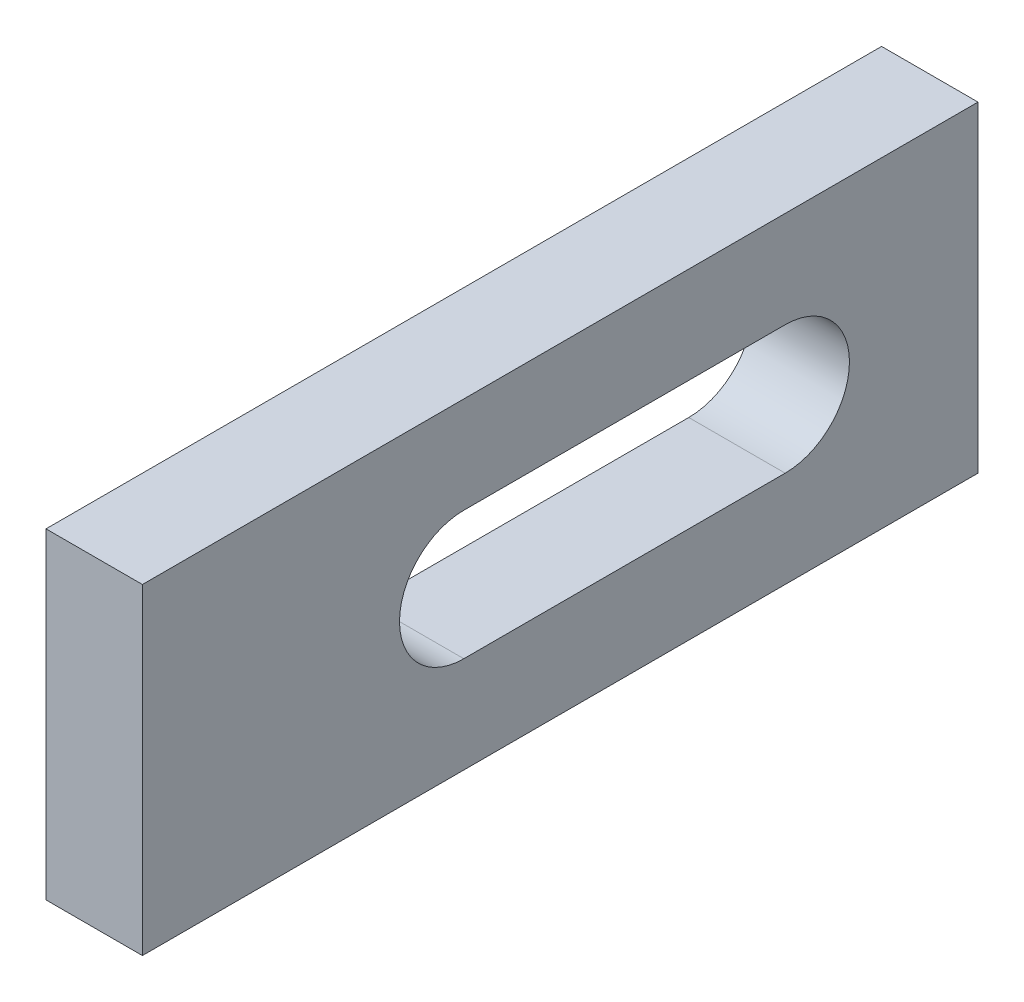
ISO-10303-21;
HEADER;
FILE_DESCRIPTION(('STEP AP214'),'2;1');
FILE_NAME('part.step','',(''),(''),'','','');
FILE_SCHEMA(('AUTOMOTIVE_DESIGN { 1 0 10303 214 1 1 1 1 }'));
ENDSEC;
DATA;
#1=APPLICATION_CONTEXT('core data for automotive mechanical design processes');
#2=APPLICATION_PROTOCOL_DEFINITION('international standard','automotive_design',2000,#1);
#3=PRODUCT_CONTEXT('',#1,'mechanical');
#4=PRODUCT('Part','Part','',(#3));
#5=PRODUCT_RELATED_PRODUCT_CATEGORY('part','',(#4));
#6=PRODUCT_DEFINITION_FORMATION('','',#4);
#7=PRODUCT_DEFINITION_CONTEXT('part definition',#1,'design');
#8=PRODUCT_DEFINITION('design','',#6,#7);
#9=PRODUCT_DEFINITION_SHAPE('','',#8);
#10=(LENGTH_UNIT() NAMED_UNIT(*) SI_UNIT(.MILLI.,.METRE.));
#11=(NAMED_UNIT(*) PLANE_ANGLE_UNIT() SI_UNIT($,.RADIAN.));
#12=(NAMED_UNIT(*) SI_UNIT($,.STERADIAN.) SOLID_ANGLE_UNIT());
#13=UNCERTAINTY_MEASURE_WITH_UNIT(LENGTH_MEASURE(1.E-05),#10,'distance_accuracy_value','');
#14=(GEOMETRIC_REPRESENTATION_CONTEXT(3) GLOBAL_UNCERTAINTY_ASSIGNED_CONTEXT((#13)) GLOBAL_UNIT_ASSIGNED_CONTEXT((#10,
#11,#12)) REPRESENTATION_CONTEXT('',''));
#15=CARTESIAN_POINT('',(0.,0.,0.));
#16=DIRECTION('',(0.,0.,1.));
#17=DIRECTION('',(1.,0.,0.));
#18=AXIS2_PLACEMENT_3D('',#15,#16,#17);
#19=CARTESIAN_POINT('',(-7.5,-24.9999999999999,65.0000000000002));
#20=DIRECTION('',(1.,0.,0.));
#21=DIRECTION('',(0.,0.,-1.));
#22=AXIS2_PLACEMENT_3D('',#19,#20,#21);
#23=PLANE('',#22);
#24=DIRECTION('',(0.,0.,1.));
#25=VECTOR('',#24,1.);
#26=CARTESIAN_POINT('',(-7.5,10.0000000000002,64.9999999999999));
#27=LINE('',#26,#25);
#28=CARTESIAN_POINT('',(-7.50000000000001,10.,-34.9999999999997));
#29=VERTEX_POINT('',#28);
#30=CARTESIAN_POINT('',(-7.50000000000001,9.99999999999979,15.0000000000002));
#31=VERTEX_POINT('',#30);
#32=EDGE_CURVE('E127',#29,#31,#27,.T.);
#33=ORIENTED_EDGE('',*,*,#32,.T.);
#34=CARTESIAN_POINT('',(-7.50000000000001,0.,15.0000000000002));
#35=DIRECTION('',(1.,0.,0.));
#36=DIRECTION('',(0.,0.,-1.));
#37=AXIS2_PLACEMENT_3D('',#34,#35,#36);
#38=CIRCLE('',#37,10.);
#39=CARTESIAN_POINT('',(-7.50000000000001,-10.,15.));
#40=VERTEX_POINT('',#39);
#41=EDGE_CURVE('E130',#31,#40,#38,.T.);
#42=ORIENTED_EDGE('',*,*,#41,.T.);
#43=DIRECTION('',(0.,0.,-1.));
#44=VECTOR('',#43,1.);
#45=CARTESIAN_POINT('',(-7.5,-9.99999999999979,65.0000000000004));
#46=LINE('',#45,#44);
#47=CARTESIAN_POINT('',(-7.5,-10.,-34.9999999999997));
#48=VERTEX_POINT('',#47);
#49=EDGE_CURVE('E122',#40,#48,#46,.T.);
#50=ORIENTED_EDGE('',*,*,#49,.T.);
#51=CARTESIAN_POINT('',(-7.50000000000001,0.,-34.9999999999999));
#52=DIRECTION('',(1.,0.,0.));
#53=DIRECTION('',(0.,0.,-1.));
#54=AXIS2_PLACEMENT_3D('',#51,#52,#53);
#55=CIRCLE('',#54,10.);
#56=EDGE_CURVE('E102',#48,#29,#55,.T.);
#57=ORIENTED_EDGE('',*,*,#56,.T.);
#58=EDGE_LOOP('',(#33,#42,#50,#57));
#59=FACE_BOUND('',#58,.T.);
#60=DIRECTION('',(0.,-1.,0.));
#61=VECTOR('',#60,1.);
#62=CARTESIAN_POINT('',(-7.5,-25.0000000000001,-64.9999999999999));
#63=LINE('',#62,#61);
#64=CARTESIAN_POINT('',(-7.5,24.9999999999999,-64.9999999999999));
#65=VERTEX_POINT('',#64);
#66=CARTESIAN_POINT('',(-7.5,-25.0000000000001,-64.9999999999999));
#67=VERTEX_POINT('',#66);
#68=EDGE_CURVE('E133',#65,#67,#63,.T.);
#69=ORIENTED_EDGE('',*,*,#68,.T.);
#70=DIRECTION('',(0.,0.,-1.));
#71=VECTOR('',#70,1.);
#72=CARTESIAN_POINT('',(-7.5,-24.9999999999999,65.0000000000002));
#73=LINE('',#72,#71);
#74=CARTESIAN_POINT('',(-7.5,-24.9999999999999,65.0000000000002));
#75=VERTEX_POINT('',#74);
#76=EDGE_CURVE('E11',#75,#67,#73,.T.);
#77=ORIENTED_EDGE('',*,*,#76,.F.);
#78=DIRECTION('',(0.,-1.,0.));
#79=VECTOR('',#78,1.);
#80=CARTESIAN_POINT('',(-7.5,-24.9999999999999,65.0000000000002));
#81=LINE('',#80,#79);
#82=CARTESIAN_POINT('',(-7.5,25.0000000000001,65.0000000000003));
#83=VERTEX_POINT('',#82);
#84=EDGE_CURVE('E134',#83,#75,#81,.T.);
#85=ORIENTED_EDGE('',*,*,#84,.F.);
#86=DIRECTION('',(0.,0.,-1.));
#87=VECTOR('',#86,1.);
#88=CARTESIAN_POINT('',(-7.5,25.0000000000001,65.0000000000003));
#89=LINE('',#88,#87);
#90=EDGE_CURVE('E144',#83,#65,#89,.T.);
#91=ORIENTED_EDGE('',*,*,#90,.T.);
#92=EDGE_LOOP('',(#69,#77,#85,#91));
#93=FACE_BOUND('',#92,.T.);
#94=ADVANCED_FACE('F32',(#59,#93),#23,.F.);
#95=CARTESIAN_POINT('',(-7.5,-24.9999999999999,65.0000000000002));
#96=DIRECTION('',(0.,1.,0.));
#97=DIRECTION('',(0.,0.,1.));
#98=AXIS2_PLACEMENT_3D('',#95,#96,#97);
#99=PLANE('',#98);
#100=DIRECTION('',(1.,0.,0.));
#101=VECTOR('',#100,1.);
#102=CARTESIAN_POINT('',(-7.5,-25.0000000000001,-64.9999999999999));
#103=LINE('',#102,#101);
#104=CARTESIAN_POINT('',(7.5,-25.0000000000001,-64.9999999999999));
#105=VERTEX_POINT('',#104);
#106=EDGE_CURVE('E147',#67,#105,#103,.T.);
#107=ORIENTED_EDGE('',*,*,#106,.T.);
#108=DIRECTION('',(0.,0.,-1.));
#109=VECTOR('',#108,1.);
#110=CARTESIAN_POINT('',(7.5,-25.0000000000001,65.0000000000002));
#111=LINE('',#110,#109);
#112=CARTESIAN_POINT('',(7.5,-25.0000000000001,65.0000000000002));
#113=VERTEX_POINT('',#112);
#114=EDGE_CURVE('E39',#113,#105,#111,.T.);
#115=ORIENTED_EDGE('',*,*,#114,.F.);
#116=DIRECTION('',(1.,0.,0.));
#117=VECTOR('',#116,1.);
#118=CARTESIAN_POINT('',(-7.5,-24.9999999999999,65.0000000000002));
#119=LINE('',#118,#117);
#120=EDGE_CURVE('E137',#75,#113,#119,.T.);
#121=ORIENTED_EDGE('',*,*,#120,.F.);
#122=ORIENTED_EDGE('',*,*,#76,.T.);
#123=EDGE_LOOP('',(#107,#115,#121,#122));
#124=FACE_BOUND('',#123,.T.);
#125=ADVANCED_FACE('F175',(#124),#99,.F.);
#126=CARTESIAN_POINT('',(7.5,-25.0000000000001,65.0000000000002));
#127=DIRECTION('',(-1.,0.,0.));
#128=DIRECTION('',(0.,0.,1.));
#129=AXIS2_PLACEMENT_3D('',#126,#127,#128);
#130=PLANE('',#129);
#131=DIRECTION('',(0.,0.,-1.));
#132=VECTOR('',#131,1.);
#133=CARTESIAN_POINT('',(7.5,-10.0000000000002,-34.9999999999999));
#134=LINE('',#133,#132);
#135=CARTESIAN_POINT('',(7.5,-10.,15.0000000000001));
#136=VERTEX_POINT('',#135);
#137=CARTESIAN_POINT('',(7.5,-10.0000000000002,-34.9999999999999));
#138=VERTEX_POINT('',#137);
#139=EDGE_CURVE('E108',#136,#138,#134,.T.);
#140=ORIENTED_EDGE('',*,*,#139,.F.);
#141=CARTESIAN_POINT('',(7.5,0.,15.0000000000001));
#142=DIRECTION('',(1.,0.,0.));
#143=DIRECTION('',(0.,0.,-1.));
#144=AXIS2_PLACEMENT_3D('',#141,#142,#143);
#145=CIRCLE('',#144,10.);
#146=CARTESIAN_POINT('',(7.5,9.99999999999979,15.0000000000002));
#147=VERTEX_POINT('',#146);
#148=EDGE_CURVE('E54',#147,#136,#145,.T.);
#149=ORIENTED_EDGE('',*,*,#148,.F.);
#150=DIRECTION('',(0.,0.,1.));
#151=VECTOR('',#150,1.);
#152=CARTESIAN_POINT('',(7.5,9.99999999999979,15.0000000000002));
#153=LINE('',#152,#151);
#154=CARTESIAN_POINT('',(7.5,10.0000000000002,-34.9999999999999));
#155=VERTEX_POINT('',#154);
#156=EDGE_CURVE('E115',#155,#147,#153,.T.);
#157=ORIENTED_EDGE('',*,*,#156,.F.);
#158=CARTESIAN_POINT('',(7.5,0.,-34.9999999999999));
#159=DIRECTION('',(1.,0.,0.));
#160=DIRECTION('',(0.,0.,-1.));
#161=AXIS2_PLACEMENT_3D('',#158,#159,#160);
#162=CIRCLE('',#161,10.);
#163=EDGE_CURVE('E99',#138,#155,#162,.T.);
#164=ORIENTED_EDGE('',*,*,#163,.F.);
#165=EDGE_LOOP('',(#140,#149,#157,#164));
#166=FACE_BOUND('',#165,.T.);
#167=DIRECTION('',(0.,1.,0.));
#168=VECTOR('',#167,1.);
#169=CARTESIAN_POINT('',(7.5,-25.0000000000001,-64.9999999999999));
#170=LINE('',#169,#168);
#171=CARTESIAN_POINT('',(7.5,24.9999999999999,-64.9999999999999));
#172=VERTEX_POINT('',#171);
#173=EDGE_CURVE('E149',#105,#172,#170,.T.);
#174=ORIENTED_EDGE('',*,*,#173,.T.);
#175=DIRECTION('',(0.,0.,-1.));
#176=VECTOR('',#175,1.);
#177=CARTESIAN_POINT('',(7.5,24.9999999999999,64.9999999999999));
#178=LINE('',#177,#176);
#179=CARTESIAN_POINT('',(7.5,24.9999999999999,64.9999999999999));
#180=VERTEX_POINT('',#179);
#181=EDGE_CURVE('E154',#180,#172,#178,.T.);
#182=ORIENTED_EDGE('',*,*,#181,.F.);
#183=DIRECTION('',(0.,1.,0.));
#184=VECTOR('',#183,1.);
#185=CARTESIAN_POINT('',(7.5,-25.0000000000001,65.0000000000002));
#186=LINE('',#185,#184);
#187=EDGE_CURVE('E140',#113,#180,#186,.T.);
#188=ORIENTED_EDGE('',*,*,#187,.F.);
#189=ORIENTED_EDGE('',*,*,#114,.T.);
#190=EDGE_LOOP('',(#174,#182,#188,#189));
#191=FACE_BOUND('',#190,.T.);
#192=ADVANCED_FACE('F112',(#166,#191),#130,.F.);
#193=CARTESIAN_POINT('',(-7.5,25.0000000000001,65.0000000000003));
#194=DIRECTION('',(0.,-1.,0.));
#195=DIRECTION('',(0.,0.,-1.));
#196=AXIS2_PLACEMENT_3D('',#193,#194,#195);
#197=PLANE('',#196);
#198=DIRECTION('',(-1.,0.,0.));
#199=VECTOR('',#198,1.);
#200=CARTESIAN_POINT('',(-7.5,24.9999999999999,-64.9999999999999));
#201=LINE('',#200,#199);
#202=EDGE_CURVE('E138',#172,#65,#201,.T.);
#203=ORIENTED_EDGE('',*,*,#202,.T.);
#204=ORIENTED_EDGE('',*,*,#90,.F.);
#205=DIRECTION('',(-1.,0.,0.));
#206=VECTOR('',#205,1.);
#207=CARTESIAN_POINT('',(-7.5,25.0000000000001,65.0000000000003));
#208=LINE('',#207,#206);
#209=EDGE_CURVE('E142',#180,#83,#208,.T.);
#210=ORIENTED_EDGE('',*,*,#209,.F.);
#211=ORIENTED_EDGE('',*,*,#181,.T.);
#212=EDGE_LOOP('',(#203,#204,#210,#211));
#213=FACE_BOUND('',#212,.T.);
#214=ADVANCED_FACE('F168',(#213),#197,.F.);
#215=CARTESIAN_POINT('',(-7.5,25.0000000000001,65.0000000000003));
#216=DIRECTION('',(0.,0.,-1.));
#217=DIRECTION('',(-1.,0.,0.));
#218=AXIS2_PLACEMENT_3D('',#215,#216,#217);
#219=PLANE('',#218);
#220=ORIENTED_EDGE('',*,*,#84,.T.);
#221=ORIENTED_EDGE('',*,*,#120,.T.);
#222=ORIENTED_EDGE('',*,*,#187,.T.);
#223=ORIENTED_EDGE('',*,*,#209,.T.);
#224=EDGE_LOOP('',(#220,#221,#222,#223));
#225=FACE_BOUND('',#224,.T.);
#226=ADVANCED_FACE('F174',(#225),#219,.F.);
#227=CARTESIAN_POINT('',(-7.5,24.9999999999999,-64.9999999999999));
#228=DIRECTION('',(0.,0.,-1.));
#229=DIRECTION('',(-1.,0.,0.));
#230=AXIS2_PLACEMENT_3D('',#227,#228,#229);
#231=PLANE('',#230);
#232=ORIENTED_EDGE('',*,*,#68,.F.);
#233=ORIENTED_EDGE('',*,*,#202,.F.);
#234=ORIENTED_EDGE('',*,*,#173,.F.);
#235=ORIENTED_EDGE('',*,*,#106,.F.);
#236=EDGE_LOOP('',(#232,#233,#234,#235));
#237=FACE_BOUND('',#236,.T.);
#238=ADVANCED_FACE('F165',(#237),#231,.T.);
#239=CARTESIAN_POINT('',(-102.5,2.22044604925031E-13,15.0000000000001));
#240=DIRECTION('',(1.,0.,0.));
#241=DIRECTION('',(0.,0.,-1.));
#242=AXIS2_PLACEMENT_3D('',#239,#240,#241);
#243=CYLINDRICAL_SURFACE('',#242,10.);
#244=DIRECTION('',(1.,0.,0.));
#245=VECTOR('',#244,1.);
#246=CARTESIAN_POINT('',(-102.5,10.,15.0000000000003));
#247=LINE('',#246,#245);
#248=EDGE_CURVE('E120',#31,#147,#247,.T.);
#249=ORIENTED_EDGE('',*,*,#248,.T.);
#250=ORIENTED_EDGE('',*,*,#148,.T.);
#251=DIRECTION('',(1.,0.,0.));
#252=VECTOR('',#251,1.);
#253=CARTESIAN_POINT('',(-102.5,-10.,15.0000000000001));
#254=LINE('',#253,#252);
#255=EDGE_CURVE('E105',#40,#136,#254,.T.);
#256=ORIENTED_EDGE('',*,*,#255,.F.);
#257=ORIENTED_EDGE('',*,*,#41,.F.);
#258=EDGE_LOOP('',(#249,#250,#256,#257));
#259=FACE_BOUND('',#258,.T.);
#260=ADVANCED_FACE('F188',(#259),#243,.F.);
#261=CARTESIAN_POINT('',(-102.5,10.,15.0000000000003));
#262=DIRECTION('',(0.,1.,0.));
#263=DIRECTION('',(0.,0.,1.));
#264=AXIS2_PLACEMENT_3D('',#261,#262,#263);
#265=PLANE('',#264);
#266=DIRECTION('',(1.,0.,0.));
#267=VECTOR('',#266,1.);
#268=CARTESIAN_POINT('',(-102.5,10.,-34.9999999999997));
#269=LINE('',#268,#267);
#270=EDGE_CURVE('E104',#29,#155,#269,.T.);
#271=ORIENTED_EDGE('',*,*,#270,.T.);
#272=ORIENTED_EDGE('',*,*,#156,.T.);
#273=ORIENTED_EDGE('',*,*,#248,.F.);
#274=ORIENTED_EDGE('',*,*,#32,.F.);
#275=EDGE_LOOP('',(#271,#272,#273,#274));
#276=FACE_BOUND('',#275,.T.);
#277=ADVANCED_FACE('F193',(#276),#265,.F.);
#278=CARTESIAN_POINT('',(-102.5,-2.22044604925031E-13,-35.0000000000001));
#279=DIRECTION('',(1.,0.,0.));
#280=DIRECTION('',(0.,0.,-1.));
#281=AXIS2_PLACEMENT_3D('',#278,#279,#280);
#282=CYLINDRICAL_SURFACE('',#281,10.);
#283=DIRECTION('',(1.,0.,0.));
#284=VECTOR('',#283,1.);
#285=CARTESIAN_POINT('',(-102.5,-9.99999999999979,-34.9999999999999));
#286=LINE('',#285,#284);
#287=EDGE_CURVE('E46',#48,#138,#286,.T.);
#288=ORIENTED_EDGE('',*,*,#287,.T.);
#289=ORIENTED_EDGE('',*,*,#163,.T.);
#290=ORIENTED_EDGE('',*,*,#270,.F.);
#291=ORIENTED_EDGE('',*,*,#56,.F.);
#292=EDGE_LOOP('',(#288,#289,#290,#291));
#293=FACE_BOUND('',#292,.T.);
#294=ADVANCED_FACE('F96',(#293),#282,.F.);
#295=CARTESIAN_POINT('',(-102.5,-9.99999999999979,-34.9999999999999));
#296=DIRECTION('',(0.,-1.,0.));
#297=DIRECTION('',(0.,0.,-1.));
#298=AXIS2_PLACEMENT_3D('',#295,#296,#297);
#299=PLANE('',#298);
#300=ORIENTED_EDGE('',*,*,#255,.T.);
#301=ORIENTED_EDGE('',*,*,#139,.T.);
#302=ORIENTED_EDGE('',*,*,#287,.F.);
#303=ORIENTED_EDGE('',*,*,#49,.F.);
#304=EDGE_LOOP('',(#300,#301,#302,#303));
#305=FACE_BOUND('',#304,.T.);
#306=ADVANCED_FACE('F109',(#305),#299,.F.);
#307=CLOSED_SHELL('',(#94,#125,#192,#214,#226,#238,#260,#277,#294,#306));
#308=MANIFOLD_SOLID_BREP('B2',#307);
#309=ADVANCED_BREP_SHAPE_REPRESENTATION('',(#18,#308),#14);
#310=SHAPE_DEFINITION_REPRESENTATION(#9,#309);
ENDSEC;
END-ISO-10303-21;
